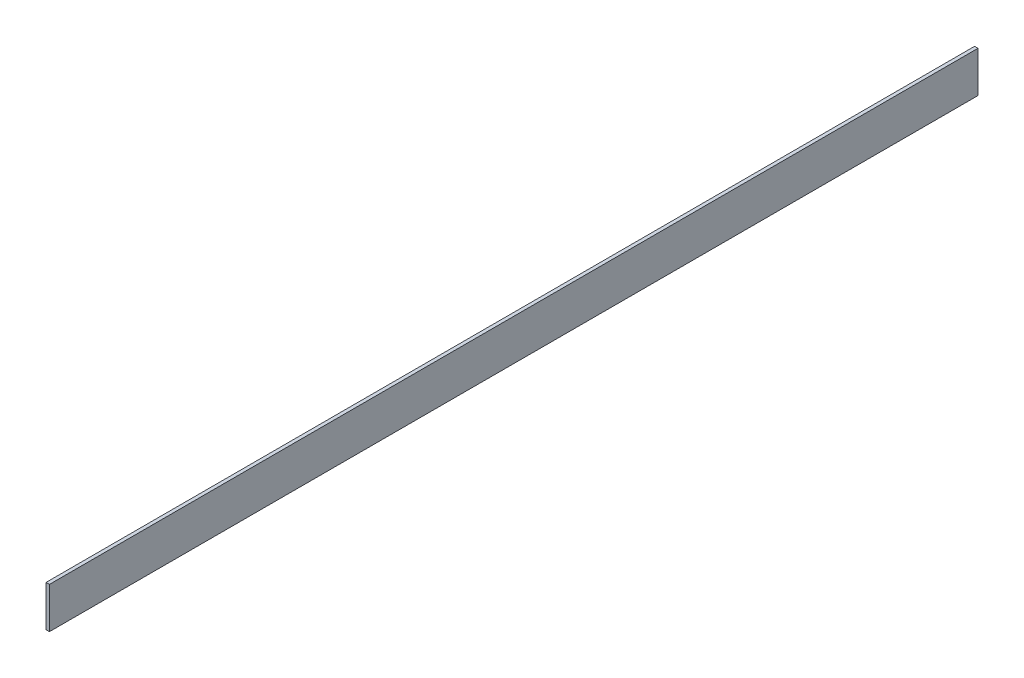
ISO-10303-21;
HEADER;
FILE_DESCRIPTION(('STEP AP214'),'2;1');
FILE_NAME('part.step','',(''),(''),'','','');
FILE_SCHEMA(('AUTOMOTIVE_DESIGN { 1 0 10303 214 1 1 1 1 }'));
ENDSEC;
DATA;
#1=APPLICATION_CONTEXT('core data for automotive mechanical design processes');
#2=APPLICATION_PROTOCOL_DEFINITION('international standard','automotive_design',2000,#1);
#3=PRODUCT_CONTEXT('',#1,'mechanical');
#4=PRODUCT('Part','Part','',(#3));
#5=PRODUCT_RELATED_PRODUCT_CATEGORY('part','',(#4));
#6=PRODUCT_DEFINITION_FORMATION('','',#4);
#7=PRODUCT_DEFINITION_CONTEXT('part definition',#1,'design');
#8=PRODUCT_DEFINITION('design','',#6,#7);
#9=PRODUCT_DEFINITION_SHAPE('','',#8);
#10=(LENGTH_UNIT() NAMED_UNIT(*) SI_UNIT(.MILLI.,.METRE.));
#11=(NAMED_UNIT(*) PLANE_ANGLE_UNIT() SI_UNIT($,.RADIAN.));
#12=(NAMED_UNIT(*) SI_UNIT($,.STERADIAN.) SOLID_ANGLE_UNIT());
#13=UNCERTAINTY_MEASURE_WITH_UNIT(LENGTH_MEASURE(1.E-05),#10,'distance_accuracy_value','');
#14=(GEOMETRIC_REPRESENTATION_CONTEXT(3) GLOBAL_UNCERTAINTY_ASSIGNED_CONTEXT((#13)) GLOBAL_UNIT_ASSIGNED_CONTEXT((#10,
#11,#12)) REPRESENTATION_CONTEXT('',''));
#15=CARTESIAN_POINT('',(0.,0.,0.));
#16=DIRECTION('',(0.,0.,1.));
#17=DIRECTION('',(1.,0.,0.));
#18=AXIS2_PLACEMENT_3D('',#15,#16,#17);
#19=CARTESIAN_POINT('',(0.,38.1,0.));
#20=DIRECTION('',(1.,0.,0.));
#21=DIRECTION('',(0.,0.,-1.));
#22=AXIS2_PLACEMENT_3D('',#19,#20,#21);
#23=PLANE('',#22);
#24=DIRECTION('',(0.,0.,1.));
#25=VECTOR('',#24,1.);
#26=CARTESIAN_POINT('',(0.,0.,0.));
#27=LINE('',#26,#25);
#28=CARTESIAN_POINT('',(0.,0.,-863.6));
#29=VERTEX_POINT('',#28);
#30=CARTESIAN_POINT('',(0.,0.,0.));
#31=VERTEX_POINT('',#30);
#32=EDGE_CURVE('E96',#29,#31,#27,.T.);
#33=ORIENTED_EDGE('',*,*,#32,.T.);
#34=DIRECTION('',(0.,-1.,0.));
#35=VECTOR('',#34,1.);
#36=CARTESIAN_POINT('',(0.,38.1,0.));
#37=LINE('',#36,#35);
#38=CARTESIAN_POINT('',(0.,38.1,0.));
#39=VERTEX_POINT('',#38);
#40=EDGE_CURVE('E11',#39,#31,#37,.T.);
#41=ORIENTED_EDGE('',*,*,#40,.F.);
#42=DIRECTION('',(0.,0.,1.));
#43=VECTOR('',#42,1.);
#44=CARTESIAN_POINT('',(0.,38.1,0.));
#45=LINE('',#44,#43);
#46=CARTESIAN_POINT('',(0.,38.1,-863.6));
#47=VERTEX_POINT('',#46);
#48=EDGE_CURVE('E84',#47,#39,#45,.T.);
#49=ORIENTED_EDGE('',*,*,#48,.F.);
#50=DIRECTION('',(0.,-1.,0.));
#51=VECTOR('',#50,1.);
#52=CARTESIAN_POINT('',(0.,38.1,-863.6));
#53=LINE('',#52,#51);
#54=EDGE_CURVE('E92',#47,#29,#53,.T.);
#55=ORIENTED_EDGE('',*,*,#54,.T.);
#56=EDGE_LOOP('',(#33,#41,#49,#55));
#57=FACE_BOUND('',#56,.T.);
#58=ADVANCED_FACE('F33',(#57),#23,.F.);
#59=CARTESIAN_POINT('',(0.,38.1,0.));
#60=DIRECTION('',(0.,0.,-1.));
#61=DIRECTION('',(-1.,0.,0.));
#62=AXIS2_PLACEMENT_3D('',#59,#60,#61);
#63=PLANE('',#62);
#64=DIRECTION('',(1.,0.,0.));
#65=VECTOR('',#64,1.);
#66=CARTESIAN_POINT('',(0.,0.,0.));
#67=LINE('',#66,#65);
#68=CARTESIAN_POINT('',(3.175,0.,0.));
#69=VERTEX_POINT('',#68);
#70=EDGE_CURVE('E88',#31,#69,#67,.T.);
#71=ORIENTED_EDGE('',*,*,#70,.T.);
#72=DIRECTION('',(0.,-1.,0.));
#73=VECTOR('',#72,1.);
#74=CARTESIAN_POINT('',(3.175,38.1,0.));
#75=LINE('',#74,#73);
#76=CARTESIAN_POINT('',(3.175,38.1,0.));
#77=VERTEX_POINT('',#76);
#78=EDGE_CURVE('E41',#77,#69,#75,.T.);
#79=ORIENTED_EDGE('',*,*,#78,.F.);
#80=DIRECTION('',(1.,0.,0.));
#81=VECTOR('',#80,1.);
#82=CARTESIAN_POINT('',(0.,38.1,0.));
#83=LINE('',#82,#81);
#84=EDGE_CURVE('E79',#39,#77,#83,.T.);
#85=ORIENTED_EDGE('',*,*,#84,.F.);
#86=ORIENTED_EDGE('',*,*,#40,.T.);
#87=EDGE_LOOP('',(#71,#79,#85,#86));
#88=FACE_BOUND('',#87,.T.);
#89=ADVANCED_FACE('F87',(#88),#63,.F.);
#90=CARTESIAN_POINT('',(3.175,38.1,0.));
#91=DIRECTION('',(-1.,0.,0.));
#92=DIRECTION('',(0.,0.,1.));
#93=AXIS2_PLACEMENT_3D('',#90,#91,#92);
#94=PLANE('',#93);
#95=DIRECTION('',(0.,0.,-1.));
#96=VECTOR('',#95,1.);
#97=CARTESIAN_POINT('',(3.175,0.,0.));
#98=LINE('',#97,#96);
#99=CARTESIAN_POINT('',(3.175,0.,-863.6));
#100=VERTEX_POINT('',#99);
#101=EDGE_CURVE('E66',#69,#100,#98,.T.);
#102=ORIENTED_EDGE('',*,*,#101,.T.);
#103=DIRECTION('',(0.,-1.,0.));
#104=VECTOR('',#103,1.);
#105=CARTESIAN_POINT('',(3.175,38.1,-863.6));
#106=LINE('',#105,#104);
#107=CARTESIAN_POINT('',(3.175,38.1,-863.6));
#108=VERTEX_POINT('',#107);
#109=EDGE_CURVE('E89',#108,#100,#106,.T.);
#110=ORIENTED_EDGE('',*,*,#109,.F.);
#111=DIRECTION('',(0.,0.,-1.));
#112=VECTOR('',#111,1.);
#113=CARTESIAN_POINT('',(3.175,38.1,0.));
#114=LINE('',#113,#112);
#115=EDGE_CURVE('E82',#77,#108,#114,.T.);
#116=ORIENTED_EDGE('',*,*,#115,.F.);
#117=ORIENTED_EDGE('',*,*,#78,.T.);
#118=EDGE_LOOP('',(#102,#110,#116,#117));
#119=FACE_BOUND('',#118,.T.);
#120=ADVANCED_FACE('F90',(#119),#94,.F.);
#121=CARTESIAN_POINT('',(0.,38.1,-863.6));
#122=DIRECTION('',(0.,0.,1.));
#123=DIRECTION('',(1.,0.,0.));
#124=AXIS2_PLACEMENT_3D('',#121,#122,#123);
#125=PLANE('',#124);
#126=DIRECTION('',(-1.,0.,0.));
#127=VECTOR('',#126,1.);
#128=CARTESIAN_POINT('',(0.,0.,-863.6));
#129=LINE('',#128,#127);
#130=EDGE_CURVE('E72',#100,#29,#129,.T.);
#131=ORIENTED_EDGE('',*,*,#130,.T.);
#132=ORIENTED_EDGE('',*,*,#54,.F.);
#133=DIRECTION('',(-1.,0.,0.));
#134=VECTOR('',#133,1.);
#135=CARTESIAN_POINT('',(0.,38.1,-863.6));
#136=LINE('',#135,#134);
#137=EDGE_CURVE('E49',#108,#47,#136,.T.);
#138=ORIENTED_EDGE('',*,*,#137,.F.);
#139=ORIENTED_EDGE('',*,*,#109,.T.);
#140=EDGE_LOOP('',(#131,#132,#138,#139));
#141=FACE_BOUND('',#140,.T.);
#142=ADVANCED_FACE('F103',(#141),#125,.F.);
#143=CARTESIAN_POINT('',(0.,38.1,0.));
#144=DIRECTION('',(0.,-1.,0.));
#145=DIRECTION('',(0.,0.,-1.));
#146=AXIS2_PLACEMENT_3D('',#143,#144,#145);
#147=PLANE('',#146);
#148=ORIENTED_EDGE('',*,*,#48,.T.);
#149=ORIENTED_EDGE('',*,*,#84,.T.);
#150=ORIENTED_EDGE('',*,*,#115,.T.);
#151=ORIENTED_EDGE('',*,*,#137,.T.);
#152=EDGE_LOOP('',(#148,#149,#150,#151));
#153=FACE_BOUND('',#152,.T.);
#154=ADVANCED_FACE('F80',(#153),#147,.F.);
#155=CARTESIAN_POINT('',(0.,0.,0.));
#156=DIRECTION('',(0.,-1.,0.));
#157=DIRECTION('',(0.,0.,-1.));
#158=AXIS2_PLACEMENT_3D('',#155,#156,#157);
#159=PLANE('',#158);
#160=ORIENTED_EDGE('',*,*,#32,.F.);
#161=ORIENTED_EDGE('',*,*,#130,.F.);
#162=ORIENTED_EDGE('',*,*,#101,.F.);
#163=ORIENTED_EDGE('',*,*,#70,.F.);
#164=EDGE_LOOP('',(#160,#161,#162,#163));
#165=FACE_BOUND('',#164,.T.);
#166=ADVANCED_FACE('F106',(#165),#159,.T.);
#167=CLOSED_SHELL('',(#58,#89,#120,#142,#154,#166));
#168=MANIFOLD_SOLID_BREP('B2',#167);
#169=ADVANCED_BREP_SHAPE_REPRESENTATION('',(#18,#168),#14);
#170=SHAPE_DEFINITION_REPRESENTATION(#9,#169);
ENDSEC;
END-ISO-10303-21;
